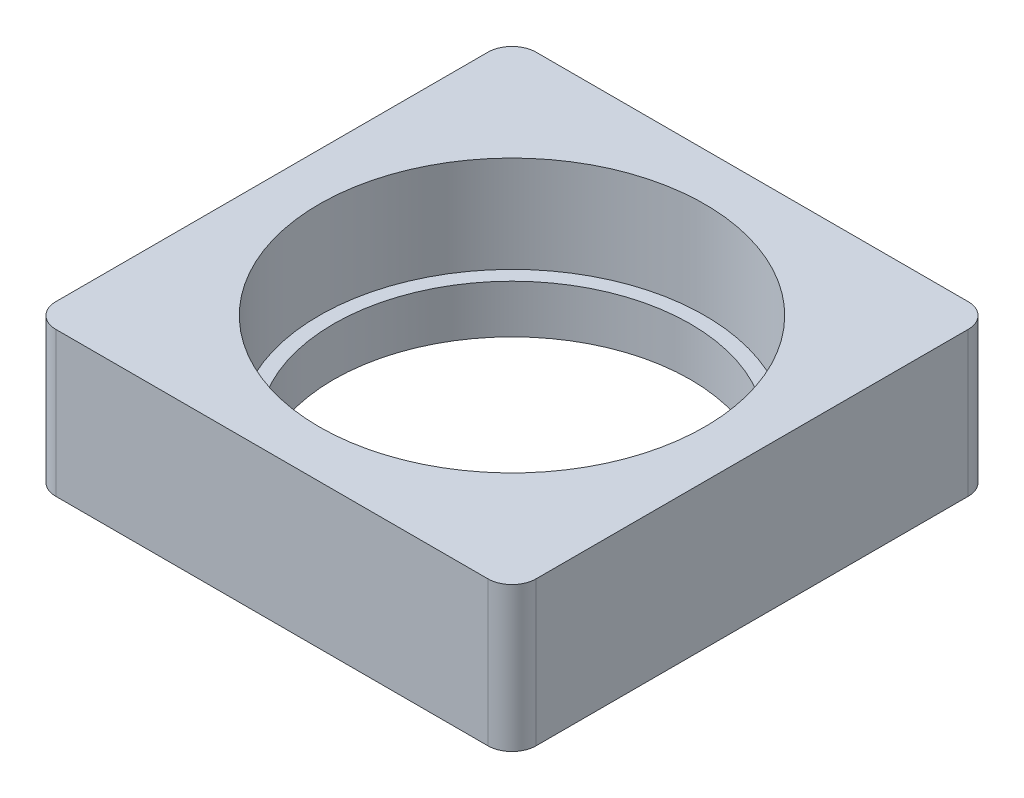
ISO-10303-21;
HEADER;
FILE_DESCRIPTION(('STEP AP214'),'2;1');
FILE_NAME('part.step','',(''),(''),'','','');
FILE_SCHEMA(('AUTOMOTIVE_DESIGN { 1 0 10303 214 1 1 1 1 }'));
ENDSEC;
DATA;
#1=APPLICATION_CONTEXT('core data for automotive mechanical design processes');
#2=APPLICATION_PROTOCOL_DEFINITION('international standard','automotive_design',2000,#1);
#3=PRODUCT_CONTEXT('',#1,'mechanical');
#4=PRODUCT('Part','Part','',(#3));
#5=PRODUCT_RELATED_PRODUCT_CATEGORY('part','',(#4));
#6=PRODUCT_DEFINITION_FORMATION('','',#4);
#7=PRODUCT_DEFINITION_CONTEXT('part definition',#1,'design');
#8=PRODUCT_DEFINITION('design','',#6,#7);
#9=PRODUCT_DEFINITION_SHAPE('','',#8);
#10=(LENGTH_UNIT() NAMED_UNIT(*) SI_UNIT(.MILLI.,.METRE.));
#11=(NAMED_UNIT(*) PLANE_ANGLE_UNIT() SI_UNIT($,.RADIAN.));
#12=(NAMED_UNIT(*) SI_UNIT($,.STERADIAN.) SOLID_ANGLE_UNIT());
#13=UNCERTAINTY_MEASURE_WITH_UNIT(LENGTH_MEASURE(1.E-05),#10,'distance_accuracy_value','');
#14=(GEOMETRIC_REPRESENTATION_CONTEXT(3) GLOBAL_UNCERTAINTY_ASSIGNED_CONTEXT((#13)) GLOBAL_UNIT_ASSIGNED_CONTEXT((#10,
#11,#12)) REPRESENTATION_CONTEXT('',''));
#15=CARTESIAN_POINT('',(0.,0.,0.));
#16=DIRECTION('',(0.,0.,1.));
#17=DIRECTION('',(1.,0.,0.));
#18=AXIS2_PLACEMENT_3D('',#15,#16,#17);
#19=CARTESIAN_POINT('',(1.5748,4.7625,-4.572));
#20=DIRECTION('',(-1.,0.,0.));
#21=DIRECTION('',(0.,0.,1.));
#22=AXIS2_PLACEMENT_3D('',#19,#20,#21);
#23=PLANE('',#22);
#24=CARTESIAN_POINT('',(1.5748,4.7625,-4.572));
#25=DIRECTION('',(-1.,0.,0.));
#26=DIRECTION('',(0.,0.,1.));
#27=AXIS2_PLACEMENT_3D('',#24,#25,#26);
#28=CIRCLE('',#27,3.1623);
#29=CARTESIAN_POINT('',(1.5748,4.7625,-1.4097));
#30=VERTEX_POINT('',#29);
#31=EDGE_CURVE('E235',#30,#30,#28,.T.);
#32=ORIENTED_EDGE('',*,*,#31,.T.);
#33=EDGE_LOOP('',(#32));
#34=FACE_BOUND('',#33,.T.);
#35=ADVANCED_FACE('F16',(#34),#23,.T.);
#36=CARTESIAN_POINT('',(15.8115,-35.9210244842766,-15.8115));
#37=DIRECTION('',(0.,1.,0.));
#38=DIRECTION('',(0.,0.,1.));
#39=AXIS2_PLACEMENT_3D('',#36,#37,#38);
#40=CYLINDRICAL_SURFACE('',#39,12.7);
#41=CARTESIAN_POINT('',(15.8115,3.175,-15.8115));
#42=DIRECTION('',(0.,1.,0.));
#43=DIRECTION('',(0.,0.,1.));
#44=AXIS2_PLACEMENT_3D('',#41,#42,#43);
#45=CIRCLE('',#44,12.7);
#46=CARTESIAN_POINT('',(15.8115,3.175,-3.1115));
#47=VERTEX_POINT('',#46);
#48=EDGE_CURVE('E19',#47,#47,#45,.F.);
#49=ORIENTED_EDGE('',*,*,#48,.T.);
#50=EDGE_LOOP('',(#49));
#51=FACE_BOUND('',#50,.T.);
#52=CARTESIAN_POINT('',(15.8115,9.525,-15.8115));
#53=DIRECTION('',(0.,1.,0.));
#54=DIRECTION('',(0.,0.,1.));
#55=AXIS2_PLACEMENT_3D('',#52,#53,#54);
#56=CIRCLE('',#55,12.7);
#57=CARTESIAN_POINT('',(15.8115,9.525,-3.1115));
#58=VERTEX_POINT('',#57);
#59=EDGE_CURVE('E237',#58,#58,#56,.T.);
#60=ORIENTED_EDGE('',*,*,#59,.T.);
#61=EDGE_LOOP('',(#60));
#62=FACE_BOUND('',#61,.T.);
#63=ADVANCED_FACE('F247',(#51,#62),#40,.F.);
#64=CARTESIAN_POINT('',(0.,3.175,0.));
#65=DIRECTION('',(0.,-1.,0.));
#66=DIRECTION('',(0.,0.,-1.));
#67=AXIS2_PLACEMENT_3D('',#64,#65,#66);
#68=PLANE('',#67);
#69=CARTESIAN_POINT('',(15.8115,3.175,-15.8115));
#70=DIRECTION('',(0.,1.,0.));
#71=DIRECTION('',(0.,0.,1.));
#72=AXIS2_PLACEMENT_3D('',#69,#70,#71);
#73=CIRCLE('',#72,11.7475);
#74=CARTESIAN_POINT('',(15.8115,3.175,-4.064));
#75=VERTEX_POINT('',#74);
#76=EDGE_CURVE('E122',#75,#75,#73,.F.);
#77=ORIENTED_EDGE('',*,*,#76,.T.);
#78=EDGE_LOOP('',(#77));
#79=FACE_BOUND('',#78,.T.);
#80=ORIENTED_EDGE('',*,*,#48,.F.);
#81=EDGE_LOOP('',(#80));
#82=FACE_BOUND('',#81,.T.);
#83=ADVANCED_FACE('F192',(#79,#82),#68,.F.);
#84=CARTESIAN_POINT('',(1.5748,4.7625,-4.572));
#85=DIRECTION('',(-1.,0.,0.));
#86=DIRECTION('',(0.,0.,1.));
#87=AXIS2_PLACEMENT_3D('',#84,#85,#86);
#88=CYLINDRICAL_SURFACE('',#87,3.1623);
#89=CARTESIAN_POINT('',(0.,4.7625,-4.572));
#90=DIRECTION('',(-1.,0.,0.));
#91=DIRECTION('',(0.,0.,1.));
#92=AXIS2_PLACEMENT_3D('',#89,#90,#91);
#93=CIRCLE('',#92,3.1623);
#94=CARTESIAN_POINT('',(0.,5.80791907386464,-1.5875));
#95=VERTEX_POINT('',#94);
#96=CARTESIAN_POINT('',(0.,3.71708092613536,-1.5875));
#97=VERTEX_POINT('',#96);
#98=EDGE_CURVE('E144',#95,#97,#93,.T.);
#99=ORIENTED_EDGE('',*,*,#98,.T.);
#100=CARTESIAN_POINT('',(0.,5.80791907386464,-1.5875));
#101=CARTESIAN_POINT('',(2.21469381864389E-06,5.76543072385641,-1.57261710446023));
#102=CARTESIAN_POINT('',(0.000208960677507276,5.72263085381354,-1.55864380412265));
#103=CARTESIAN_POINT('',(0.000897624958865748,5.63647642581595,-1.53253737760836));
#104=CARTESIAN_POINT('',(0.00137953822386666,5.59312187802019,-1.52040421778156));
#105=CARTESIAN_POINT('',(0.00303694623328012,5.46234767019402,-1.48680112376522));
#106=CARTESIAN_POINT('',(0.00442424096767263,5.374196644088,-1.4681202917167));
#107=CARTESIAN_POINT('',(0.00691701924513229,5.19908724564886,-1.43875921328412));
#108=CARTESIAN_POINT('',(0.00802923257560603,5.11216325983567,-1.42787208949064));
#109=CARTESIAN_POINT('',(0.00956457345174745,4.93770899313758,-1.4133448523383));
#110=CARTESIAN_POINT('',(0.00998776089574341,4.85017876561883,-1.4097041090317));
#111=CARTESIAN_POINT('',(0.00998868227418239,4.67509393769335,-1.40969589680216));
#112=CARTESIAN_POINT('',(0.0095661843419069,4.58753933718492,-1.41333042258415));
#113=CARTESIAN_POINT('',(0.00803156157409693,4.41303611404772,-1.42784925211999));
#114=CARTESIAN_POINT('',(0.00691937644476932,4.32608754507152,-1.43873418972509));
#115=CARTESIAN_POINT('',(0.00442614760161724,4.15092792044109,-1.46809500897624));
#116=CARTESIAN_POINT('',(0.0030383580623584,4.06275126975242,-1.48677794109248));
#117=CARTESIAN_POINT('',(0.00138023691170389,3.93193933726919,-1.52038736834083));
#118=CARTESIAN_POINT('',(0.00089809078376427,3.88857233703908,-1.53252316845373));
#119=CARTESIAN_POINT('',(0.000209078381713718,3.80239329523531,-1.55863592020701));
#120=CARTESIAN_POINT('',(2.21714094926195E-06,3.75958126382295,-1.57261290550673));
#121=CARTESIAN_POINT('',(0.,3.71708092613536,-1.5875));
#122=B_SPLINE_CURVE_WITH_KNOTS('',3,(#100,#101,#102,#103,#104,#105,#106,#107,#108,#109,#110,
#111,#112,#113,#114,#115,#116,#117,#118,#119,#120,#121),.UNSPECIFIED.,.F.,.F.,(4,2,2,2,2,2,2,2,
2,2,4),(0.,0.135035182475541,0.270067895305719,0.540067419621777,0.802603660730558,
1.06511707784674,1.32770247972674,1.59031084056897,1.8603865825587,1.99545738041359,
2.13053064788746),.UNSPECIFIED.);
#123=EDGE_CURVE('E120',#95,#97,#122,.T.);
#124=ORIENTED_EDGE('',*,*,#123,.F.);
#125=EDGE_LOOP('',(#99,#124));
#126=FACE_BOUND('',#125,.T.);
#127=ORIENTED_EDGE('',*,*,#31,.F.);
#128=EDGE_LOOP('',(#127));
#129=FACE_BOUND('',#128,.T.);
#130=ADVANCED_FACE('F156',(#126,#129),#88,.F.);
#131=CARTESIAN_POINT('',(0.,9.525,0.));
#132=DIRECTION('',(0.,-1.,0.));
#133=DIRECTION('',(0.,0.,-1.));
#134=AXIS2_PLACEMENT_3D('',#131,#132,#133);
#135=PLANE('',#134);
#136=CARTESIAN_POINT('',(30.0355,9.525,-30.0355));
#137=DIRECTION('',(0.,-1.,0.));
#138=DIRECTION('',(0.,0.,-1.));
#139=AXIS2_PLACEMENT_3D('',#136,#137,#138);
#140=CIRCLE('',#139,1.5875);
#141=CARTESIAN_POINT('',(30.0355,9.525,-31.623));
#142=VERTEX_POINT('',#141);
#143=CARTESIAN_POINT('',(31.623,9.525,-30.0355));
#144=VERTEX_POINT('',#143);
#145=EDGE_CURVE('E85',#142,#144,#140,.T.);
#146=ORIENTED_EDGE('',*,*,#145,.F.);
#147=DIRECTION('',(1.,0.,0.));
#148=VECTOR('',#147,1.);
#149=CARTESIAN_POINT('',(0.,9.525,-31.623));
#150=LINE('',#149,#148);
#151=CARTESIAN_POINT('',(1.5875,9.525,-31.623));
#152=VERTEX_POINT('',#151);
#153=EDGE_CURVE('E104',#142,#152,#150,.F.);
#154=ORIENTED_EDGE('',*,*,#153,.T.);
#155=CARTESIAN_POINT('',(1.5875,9.525,-30.0355));
#156=DIRECTION('',(0.,-1.,0.));
#157=DIRECTION('',(0.,0.,-1.));
#158=AXIS2_PLACEMENT_3D('',#155,#156,#157);
#159=CIRCLE('',#158,1.5875);
#160=CARTESIAN_POINT('',(0.,9.525,-30.0355));
#161=VERTEX_POINT('',#160);
#162=EDGE_CURVE('E139',#161,#152,#159,.T.);
#163=ORIENTED_EDGE('',*,*,#162,.F.);
#164=DIRECTION('',(0.,0.,-1.));
#165=VECTOR('',#164,1.);
#166=CARTESIAN_POINT('',(0.,9.525,0.));
#167=LINE('',#166,#165);
#168=CARTESIAN_POINT('',(0.,9.525,-1.5875));
#169=VERTEX_POINT('',#168);
#170=EDGE_CURVE('E117',#161,#169,#167,.F.);
#171=ORIENTED_EDGE('',*,*,#170,.T.);
#172=CARTESIAN_POINT('',(1.5875,9.525,-1.5875));
#173=DIRECTION('',(0.,-1.,0.));
#174=DIRECTION('',(0.,0.,-1.));
#175=AXIS2_PLACEMENT_3D('',#172,#173,#174);
#176=CIRCLE('',#175,1.5875);
#177=CARTESIAN_POINT('',(1.5875,9.525,0.));
#178=VERTEX_POINT('',#177);
#179=EDGE_CURVE('E148',#178,#169,#176,.T.);
#180=ORIENTED_EDGE('',*,*,#179,.F.);
#181=DIRECTION('',(-1.,0.,0.));
#182=VECTOR('',#181,1.);
#183=CARTESIAN_POINT('',(0.,9.525,0.));
#184=LINE('',#183,#182);
#185=CARTESIAN_POINT('',(30.0355,9.525,0.));
#186=VERTEX_POINT('',#185);
#187=EDGE_CURVE('E123',#178,#186,#184,.F.);
#188=ORIENTED_EDGE('',*,*,#187,.T.);
#189=CARTESIAN_POINT('',(30.0355,9.525,-1.5875));
#190=DIRECTION('',(0.,-1.,0.));
#191=DIRECTION('',(0.,0.,-1.));
#192=AXIS2_PLACEMENT_3D('',#189,#190,#191);
#193=CIRCLE('',#192,1.5875);
#194=CARTESIAN_POINT('',(31.623,9.525,-1.5875));
#195=VERTEX_POINT('',#194);
#196=EDGE_CURVE('E92',#195,#186,#193,.T.);
#197=ORIENTED_EDGE('',*,*,#196,.F.);
#198=DIRECTION('',(0.,0.,1.));
#199=VECTOR('',#198,1.);
#200=CARTESIAN_POINT('',(31.623,9.525,0.));
#201=LINE('',#200,#199);
#202=EDGE_CURVE('E88',#195,#144,#201,.F.);
#203=ORIENTED_EDGE('',*,*,#202,.T.);
#204=EDGE_LOOP('',(#146,#154,#163,#171,#180,#188,#197,#203));
#205=FACE_BOUND('',#204,.T.);
#206=ORIENTED_EDGE('',*,*,#59,.F.);
#207=EDGE_LOOP('',(#206));
#208=FACE_BOUND('',#207,.T.);
#209=ADVANCED_FACE('F89',(#205,#208),#135,.F.);
#210=CARTESIAN_POINT('',(15.8115,0.,-15.8115));
#211=DIRECTION('',(0.,1.,0.));
#212=DIRECTION('',(0.,0.,1.));
#213=AXIS2_PLACEMENT_3D('',#210,#211,#212);
#214=CYLINDRICAL_SURFACE('',#213,11.7475);
#215=ORIENTED_EDGE('',*,*,#76,.F.);
#216=EDGE_LOOP('',(#215));
#217=FACE_BOUND('',#216,.T.);
#218=CARTESIAN_POINT('',(15.8115,0.,-15.8115));
#219=DIRECTION('',(0.,1.,0.));
#220=DIRECTION('',(0.,0.,1.));
#221=AXIS2_PLACEMENT_3D('',#218,#219,#220);
#222=CIRCLE('',#221,11.7475);
#223=CARTESIAN_POINT('',(15.8115,0.,-4.064));
#224=VERTEX_POINT('',#223);
#225=EDGE_CURVE('E136',#224,#224,#222,.T.);
#226=ORIENTED_EDGE('',*,*,#225,.F.);
#227=EDGE_LOOP('',(#226));
#228=FACE_BOUND('',#227,.T.);
#229=ADVANCED_FACE('F183',(#217,#228),#214,.F.);
#230=CARTESIAN_POINT('',(0.,9.525,-31.623));
#231=DIRECTION('',(0.,0.,1.));
#232=DIRECTION('',(1.,0.,0.));
#233=AXIS2_PLACEMENT_3D('',#230,#231,#232);
#234=PLANE('',#233);
#235=DIRECTION('',(0.,-1.,0.));
#236=VECTOR('',#235,1.);
#237=CARTESIAN_POINT('',(30.0355,9.525,-31.623));
#238=LINE('',#237,#236);
#239=CARTESIAN_POINT('',(30.0355,0.,-31.623));
#240=VERTEX_POINT('',#239);
#241=EDGE_CURVE('E97',#240,#142,#238,.F.);
#242=ORIENTED_EDGE('',*,*,#241,.F.);
#243=DIRECTION('',(1.,0.,0.));
#244=VECTOR('',#243,1.);
#245=CARTESIAN_POINT('',(0.,0.,-31.623));
#246=LINE('',#245,#244);
#247=CARTESIAN_POINT('',(1.5875,0.,-31.623));
#248=VERTEX_POINT('',#247);
#249=EDGE_CURVE('E135',#248,#240,#246,.T.);
#250=ORIENTED_EDGE('',*,*,#249,.F.);
#251=DIRECTION('',(0.,-1.,0.));
#252=VECTOR('',#251,1.);
#253=CARTESIAN_POINT('',(1.5875,9.525,-31.623));
#254=LINE('',#253,#252);
#255=EDGE_CURVE('E142',#152,#248,#254,.T.);
#256=ORIENTED_EDGE('',*,*,#255,.F.);
#257=ORIENTED_EDGE('',*,*,#153,.F.);
#258=EDGE_LOOP('',(#242,#250,#256,#257));
#259=FACE_BOUND('',#258,.T.);
#260=ADVANCED_FACE('F180',(#259),#234,.F.);
#261=CARTESIAN_POINT('',(30.0355,9.525,-30.0355));
#262=DIRECTION('',(0.,-1.,0.));
#263=DIRECTION('',(0.,0.,-1.));
#264=AXIS2_PLACEMENT_3D('',#261,#262,#263);
#265=CYLINDRICAL_SURFACE('',#264,1.5875);
#266=CARTESIAN_POINT('',(30.0355,0.,-30.0355));
#267=DIRECTION('',(0.,-1.,0.));
#268=DIRECTION('',(0.,0.,-1.));
#269=AXIS2_PLACEMENT_3D('',#266,#267,#268);
#270=CIRCLE('',#269,1.5875);
#271=CARTESIAN_POINT('',(31.623,0.,-30.0355));
#272=VERTEX_POINT('',#271);
#273=EDGE_CURVE('E133',#240,#272,#270,.T.);
#274=ORIENTED_EDGE('',*,*,#273,.F.);
#275=ORIENTED_EDGE('',*,*,#241,.T.);
#276=ORIENTED_EDGE('',*,*,#145,.T.);
#277=DIRECTION('',(0.,1.,0.));
#278=VECTOR('',#277,1.);
#279=CARTESIAN_POINT('',(31.623,9.525,-30.0355));
#280=LINE('',#279,#278);
#281=EDGE_CURVE('E96',#144,#272,#280,.F.);
#282=ORIENTED_EDGE('',*,*,#281,.T.);
#283=EDGE_LOOP('',(#274,#275,#276,#282));
#284=FACE_BOUND('',#283,.T.);
#285=ADVANCED_FACE('F102',(#284),#265,.T.);
#286=CARTESIAN_POINT('',(31.623,9.525,0.));
#287=DIRECTION('',(-1.,0.,0.));
#288=DIRECTION('',(0.,0.,1.));
#289=AXIS2_PLACEMENT_3D('',#286,#287,#288);
#290=PLANE('',#289);
#291=ORIENTED_EDGE('',*,*,#281,.F.);
#292=ORIENTED_EDGE('',*,*,#202,.F.);
#293=DIRECTION('',(0.,-1.,0.));
#294=VECTOR('',#293,1.);
#295=CARTESIAN_POINT('',(31.623,9.525,-1.5875));
#296=LINE('',#295,#294);
#297=CARTESIAN_POINT('',(31.623,0.,-1.5875));
#298=VERTEX_POINT('',#297);
#299=EDGE_CURVE('E111',#298,#195,#296,.F.);
#300=ORIENTED_EDGE('',*,*,#299,.F.);
#301=DIRECTION('',(0.,0.,-1.));
#302=VECTOR('',#301,1.);
#303=CARTESIAN_POINT('',(31.623,0.,0.));
#304=LINE('',#303,#302);
#305=EDGE_CURVE('E108',#272,#298,#304,.F.);
#306=ORIENTED_EDGE('',*,*,#305,.F.);
#307=EDGE_LOOP('',(#291,#292,#300,#306));
#308=FACE_BOUND('',#307,.T.);
#309=ADVANCED_FACE('F106',(#308),#290,.F.);
#310=CARTESIAN_POINT('',(30.0355,9.525,-1.5875));
#311=DIRECTION('',(0.,-1.,0.));
#312=DIRECTION('',(0.,0.,-1.));
#313=AXIS2_PLACEMENT_3D('',#310,#311,#312);
#314=CYLINDRICAL_SURFACE('',#313,1.5875);
#315=CARTESIAN_POINT('',(30.0355,0.,-1.5875));
#316=DIRECTION('',(0.,-1.,0.));
#317=DIRECTION('',(0.,0.,-1.));
#318=AXIS2_PLACEMENT_3D('',#315,#316,#317);
#319=CIRCLE('',#318,1.5875);
#320=CARTESIAN_POINT('',(30.0355,0.,0.));
#321=VERTEX_POINT('',#320);
#322=EDGE_CURVE('E130',#298,#321,#319,.T.);
#323=ORIENTED_EDGE('',*,*,#322,.F.);
#324=ORIENTED_EDGE('',*,*,#299,.T.);
#325=ORIENTED_EDGE('',*,*,#196,.T.);
#326=DIRECTION('',(0.,1.,0.));
#327=VECTOR('',#326,1.);
#328=CARTESIAN_POINT('',(30.0355,9.525,0.));
#329=LINE('',#328,#327);
#330=EDGE_CURVE('E124',#186,#321,#329,.F.);
#331=ORIENTED_EDGE('',*,*,#330,.T.);
#332=EDGE_LOOP('',(#323,#324,#325,#331));
#333=FACE_BOUND('',#332,.T.);
#334=ADVANCED_FACE('F171',(#333),#314,.T.);
#335=CARTESIAN_POINT('',(0.,9.525,0.));
#336=DIRECTION('',(0.,0.,-1.));
#337=DIRECTION('',(-1.,0.,0.));
#338=AXIS2_PLACEMENT_3D('',#335,#336,#337);
#339=PLANE('',#338);
#340=ORIENTED_EDGE('',*,*,#330,.F.);
#341=ORIENTED_EDGE('',*,*,#187,.F.);
#342=DIRECTION('',(0.,-1.,0.));
#343=VECTOR('',#342,1.);
#344=CARTESIAN_POINT('',(1.5875,9.525,0.));
#345=LINE('',#344,#343);
#346=CARTESIAN_POINT('',(1.5875,0.,0.));
#347=VERTEX_POINT('',#346);
#348=EDGE_CURVE('E222',#347,#178,#345,.F.);
#349=ORIENTED_EDGE('',*,*,#348,.F.);
#350=DIRECTION('',(1.,0.,0.));
#351=VECTOR('',#350,1.);
#352=CARTESIAN_POINT('',(0.,0.,0.));
#353=LINE('',#352,#351);
#354=EDGE_CURVE('E129',#321,#347,#353,.F.);
#355=ORIENTED_EDGE('',*,*,#354,.F.);
#356=EDGE_LOOP('',(#340,#341,#349,#355));
#357=FACE_BOUND('',#356,.T.);
#358=ADVANCED_FACE('F166',(#357),#339,.F.);
#359=CARTESIAN_POINT('',(1.5875,9.525,-1.5875));
#360=DIRECTION('',(0.,-1.,0.));
#361=DIRECTION('',(0.,0.,-1.));
#362=AXIS2_PLACEMENT_3D('',#359,#360,#361);
#363=CYLINDRICAL_SURFACE('',#362,1.5875);
#364=DIRECTION('',(0.,1.,0.));
#365=VECTOR('',#364,1.);
#366=CARTESIAN_POINT('',(0.,9.525,-1.5875));
#367=LINE('',#366,#365);
#368=EDGE_CURVE('E119',#169,#95,#367,.F.);
#369=ORIENTED_EDGE('',*,*,#368,.T.);
#370=ORIENTED_EDGE('',*,*,#123,.T.);
#371=DIRECTION('',(0.,1.,0.));
#372=VECTOR('',#371,1.);
#373=CARTESIAN_POINT('',(0.,9.525,-1.5875));
#374=LINE('',#373,#372);
#375=CARTESIAN_POINT('',(0.,0.,-1.5875));
#376=VERTEX_POINT('',#375);
#377=EDGE_CURVE('E143',#97,#376,#374,.F.);
#378=ORIENTED_EDGE('',*,*,#377,.T.);
#379=CARTESIAN_POINT('',(1.5875,0.,-1.5875));
#380=DIRECTION('',(0.,-1.,0.));
#381=DIRECTION('',(0.,0.,-1.));
#382=AXIS2_PLACEMENT_3D('',#379,#380,#381);
#383=CIRCLE('',#382,1.5875);
#384=EDGE_CURVE('E126',#347,#376,#383,.T.);
#385=ORIENTED_EDGE('',*,*,#384,.F.);
#386=ORIENTED_EDGE('',*,*,#348,.T.);
#387=ORIENTED_EDGE('',*,*,#179,.T.);
#388=EDGE_LOOP('',(#369,#370,#378,#385,#386,#387));
#389=FACE_BOUND('',#388,.T.);
#390=ADVANCED_FACE('F160',(#389),#363,.T.);
#391=CARTESIAN_POINT('',(0.,9.525,0.));
#392=DIRECTION('',(1.,0.,0.));
#393=DIRECTION('',(0.,0.,-1.));
#394=AXIS2_PLACEMENT_3D('',#391,#392,#393);
#395=PLANE('',#394);
#396=ORIENTED_EDGE('',*,*,#98,.F.);
#397=ORIENTED_EDGE('',*,*,#368,.F.);
#398=ORIENTED_EDGE('',*,*,#170,.F.);
#399=DIRECTION('',(0.,-1.,0.));
#400=VECTOR('',#399,1.);
#401=CARTESIAN_POINT('',(0.,9.525,-30.0355));
#402=LINE('',#401,#400);
#403=CARTESIAN_POINT('',(0.,0.,-30.0355));
#404=VERTEX_POINT('',#403);
#405=EDGE_CURVE('E34',#404,#161,#402,.F.);
#406=ORIENTED_EDGE('',*,*,#405,.F.);
#407=DIRECTION('',(0.,0.,-1.));
#408=VECTOR('',#407,1.);
#409=CARTESIAN_POINT('',(0.,0.,0.));
#410=LINE('',#409,#408);
#411=EDGE_CURVE('E25',#376,#404,#410,.T.);
#412=ORIENTED_EDGE('',*,*,#411,.F.);
#413=ORIENTED_EDGE('',*,*,#377,.F.);
#414=EDGE_LOOP('',(#396,#397,#398,#406,#412,#413));
#415=FACE_BOUND('',#414,.T.);
#416=ADVANCED_FACE('F165',(#415),#395,.F.);
#417=CARTESIAN_POINT('',(1.5875,9.525,-30.0355));
#418=DIRECTION('',(0.,-1.,0.));
#419=DIRECTION('',(0.,0.,-1.));
#420=AXIS2_PLACEMENT_3D('',#417,#418,#419);
#421=CYLINDRICAL_SURFACE('',#420,1.5875);
#422=CARTESIAN_POINT('',(1.5875,0.,-30.0355));
#423=DIRECTION('',(0.,-1.,0.));
#424=DIRECTION('',(0.,0.,-1.));
#425=AXIS2_PLACEMENT_3D('',#422,#423,#424);
#426=CIRCLE('',#425,1.5875);
#427=EDGE_CURVE('E11',#404,#248,#426,.T.);
#428=ORIENTED_EDGE('',*,*,#427,.F.);
#429=ORIENTED_EDGE('',*,*,#405,.T.);
#430=ORIENTED_EDGE('',*,*,#162,.T.);
#431=ORIENTED_EDGE('',*,*,#255,.T.);
#432=EDGE_LOOP('',(#428,#429,#430,#431));
#433=FACE_BOUND('',#432,.T.);
#434=ADVANCED_FACE('F196',(#433),#421,.T.);
#435=CARTESIAN_POINT('',(0.,0.,0.));
#436=DIRECTION('',(0.,-1.,0.));
#437=DIRECTION('',(0.,0.,-1.));
#438=AXIS2_PLACEMENT_3D('',#435,#436,#437);
#439=PLANE('',#438);
#440=ORIENTED_EDGE('',*,*,#411,.T.);
#441=ORIENTED_EDGE('',*,*,#427,.T.);
#442=ORIENTED_EDGE('',*,*,#249,.T.);
#443=ORIENTED_EDGE('',*,*,#273,.T.);
#444=ORIENTED_EDGE('',*,*,#305,.T.);
#445=ORIENTED_EDGE('',*,*,#322,.T.);
#446=ORIENTED_EDGE('',*,*,#354,.T.);
#447=ORIENTED_EDGE('',*,*,#384,.T.);
#448=EDGE_LOOP('',(#440,#441,#442,#443,#444,#445,#446,#447));
#449=FACE_BOUND('',#448,.T.);
#450=ORIENTED_EDGE('',*,*,#225,.T.);
#451=EDGE_LOOP('',(#450));
#452=FACE_BOUND('',#451,.T.);
#453=ADVANCED_FACE('F194',(#449,#452),#439,.T.);
#454=CLOSED_SHELL('',(#35,#63,#83,#130,#209,#229,#260,#285,#309,#334,#358,#390,#416,#434,#453));
#455=MANIFOLD_SOLID_BREP('B1',#454);
#456=ADVANCED_BREP_SHAPE_REPRESENTATION('',(#18,#455),#14);
#457=SHAPE_DEFINITION_REPRESENTATION(#9,#456);
ENDSEC;
END-ISO-10303-21;
